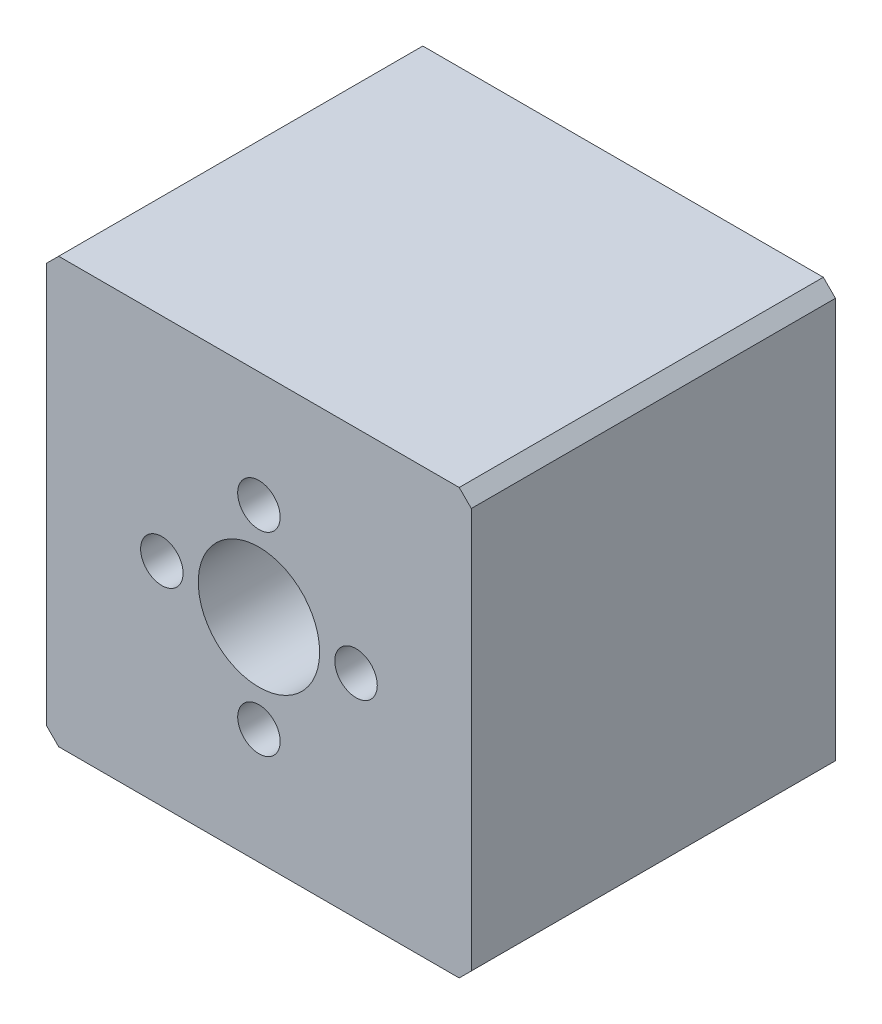
ISO-10303-21;
HEADER;
FILE_DESCRIPTION(('STEP AP214'),'2;1');
FILE_NAME('part.step','',(''),(''),'','','');
FILE_SCHEMA(('AUTOMOTIVE_DESIGN { 1 0 10303 214 1 1 1 1 }'));
ENDSEC;
DATA;
#1=APPLICATION_CONTEXT('core data for automotive mechanical design processes');
#2=APPLICATION_PROTOCOL_DEFINITION('international standard','automotive_design',2000,#1);
#3=PRODUCT_CONTEXT('',#1,'mechanical');
#4=PRODUCT('Part','Part','',(#3));
#5=PRODUCT_RELATED_PRODUCT_CATEGORY('part','',(#4));
#6=PRODUCT_DEFINITION_FORMATION('','',#4);
#7=PRODUCT_DEFINITION_CONTEXT('part definition',#1,'design');
#8=PRODUCT_DEFINITION('design','',#6,#7);
#9=PRODUCT_DEFINITION_SHAPE('','',#8);
#10=(LENGTH_UNIT() NAMED_UNIT(*) SI_UNIT(.MILLI.,.METRE.));
#11=(NAMED_UNIT(*) PLANE_ANGLE_UNIT() SI_UNIT($,.RADIAN.));
#12=(NAMED_UNIT(*) SI_UNIT($,.STERADIAN.) SOLID_ANGLE_UNIT());
#13=UNCERTAINTY_MEASURE_WITH_UNIT(LENGTH_MEASURE(1.E-05),#10,'distance_accuracy_value','');
#14=(GEOMETRIC_REPRESENTATION_CONTEXT(3) GLOBAL_UNCERTAINTY_ASSIGNED_CONTEXT((#13)) GLOBAL_UNIT_ASSIGNED_CONTEXT((#10,
#11,#12)) REPRESENTATION_CONTEXT('',''));
#15=CARTESIAN_POINT('',(0.,0.,0.));
#16=DIRECTION('',(0.,0.,1.));
#17=DIRECTION('',(1.,0.,0.));
#18=AXIS2_PLACEMENT_3D('',#15,#16,#17);
#19=CARTESIAN_POINT('',(0.,0.,15.));
#20=DIRECTION('',(0.,0.,-1.));
#21=DIRECTION('',(-1.,0.,0.));
#22=AXIS2_PLACEMENT_3D('',#19,#20,#21);
#23=PLANE('',#22);
#24=CARTESIAN_POINT('',(0.,9.50000000000001,15.));
#25=DIRECTION('',(0.,0.,1.));
#26=DIRECTION('',(1.,0.,0.));
#27=AXIS2_PLACEMENT_3D('',#24,#25,#26);
#28=CIRCLE('',#27,1.75000000000036);
#29=CARTESIAN_POINT('',(1.75000000000036,9.50000000000001,15.));
#30=VERTEX_POINT('',#29);
#31=EDGE_CURVE('E207',#30,#30,#28,.T.);
#32=ORIENTED_EDGE('',*,*,#31,.F.);
#33=EDGE_LOOP('',(#32));
#34=FACE_BOUND('',#33,.T.);
#35=CARTESIAN_POINT('',(0.,-6.50000000000001,15.));
#36=DIRECTION('',(0.,0.,1.));
#37=DIRECTION('',(1.,0.,0.));
#38=AXIS2_PLACEMENT_3D('',#35,#36,#37);
#39=CIRCLE('',#38,1.75000000000036);
#40=CARTESIAN_POINT('',(1.75000000000036,-6.50000000000001,15.));
#41=VERTEX_POINT('',#40);
#42=EDGE_CURVE('E201',#41,#41,#39,.T.);
#43=ORIENTED_EDGE('',*,*,#42,.F.);
#44=EDGE_LOOP('',(#43));
#45=FACE_BOUND('',#44,.T.);
#46=CARTESIAN_POINT('',(8.00000000000001,1.5,15.));
#47=DIRECTION('',(0.,0.,1.));
#48=DIRECTION('',(1.,0.,0.));
#49=AXIS2_PLACEMENT_3D('',#46,#47,#48);
#50=CIRCLE('',#49,1.75000000000036);
#51=CARTESIAN_POINT('',(9.75000000000037,1.5,15.));
#52=VERTEX_POINT('',#51);
#53=EDGE_CURVE('E195',#52,#52,#50,.T.);
#54=ORIENTED_EDGE('',*,*,#53,.F.);
#55=EDGE_LOOP('',(#54));
#56=FACE_BOUND('',#55,.T.);
#57=CARTESIAN_POINT('',(-8.00000000000001,1.5,15.));
#58=DIRECTION('',(0.,0.,1.));
#59=DIRECTION('',(1.,0.,0.));
#60=AXIS2_PLACEMENT_3D('',#57,#58,#59);
#61=CIRCLE('',#60,1.75000000000036);
#62=CARTESIAN_POINT('',(-6.24999999999964,1.5,15.));
#63=VERTEX_POINT('',#62);
#64=EDGE_CURVE('E188',#63,#63,#61,.T.);
#65=ORIENTED_EDGE('',*,*,#64,.F.);
#66=EDGE_LOOP('',(#65));
#67=FACE_BOUND('',#66,.T.);
#68=DIRECTION('',(0.,-1.,0.));
#69=VECTOR('',#68,1.);
#70=CARTESIAN_POINT('',(-17.5000000000001,-16.,15.));
#71=LINE('',#70,#69);
#72=CARTESIAN_POINT('',(-17.5000000000001,17.9999999999997,15.));
#73=VERTEX_POINT('',#72);
#74=CARTESIAN_POINT('',(-17.5000000000001,-15.,15.));
#75=VERTEX_POINT('',#74);
#76=EDGE_CURVE('E137',#73,#75,#71,.T.);
#77=ORIENTED_EDGE('',*,*,#76,.T.);
#78=DIRECTION('',(-0.707106781186548,0.707106781186548,0.));
#79=VECTOR('',#78,1.);
#80=CARTESIAN_POINT('',(-16.5000000000001,-16.,15.));
#81=LINE('',#80,#79);
#82=CARTESIAN_POINT('',(-16.5000000000001,-16.,15.));
#83=VERTEX_POINT('',#82);
#84=EDGE_CURVE('E152',#75,#83,#81,.F.);
#85=ORIENTED_EDGE('',*,*,#84,.T.);
#86=DIRECTION('',(1.,0.,0.));
#87=VECTOR('',#86,1.);
#88=CARTESIAN_POINT('',(17.5000000000001,-16.,15.));
#89=LINE('',#88,#87);
#90=CARTESIAN_POINT('',(16.5000000000001,-16.,15.));
#91=VERTEX_POINT('',#90);
#92=EDGE_CURVE('E119',#83,#91,#89,.T.);
#93=ORIENTED_EDGE('',*,*,#92,.T.);
#94=DIRECTION('',(-0.707106781186548,-0.707106781186548,0.));
#95=VECTOR('',#94,1.);
#96=CARTESIAN_POINT('',(17.5000000000001,-15.,15.));
#97=LINE('',#96,#95);
#98=CARTESIAN_POINT('',(17.5000000000001,-15.,15.));
#99=VERTEX_POINT('',#98);
#100=EDGE_CURVE('E150',#91,#99,#97,.F.);
#101=ORIENTED_EDGE('',*,*,#100,.T.);
#102=DIRECTION('',(0.,1.,0.));
#103=VECTOR('',#102,1.);
#104=CARTESIAN_POINT('',(17.5000000000001,18.9999999999997,15.));
#105=LINE('',#104,#103);
#106=CARTESIAN_POINT('',(17.5000000000001,17.9999999999997,15.));
#107=VERTEX_POINT('',#106);
#108=EDGE_CURVE('E172',#99,#107,#105,.T.);
#109=ORIENTED_EDGE('',*,*,#108,.T.);
#110=DIRECTION('',(0.707106781186548,-0.707106781186548,0.));
#111=VECTOR('',#110,1.);
#112=CARTESIAN_POINT('',(16.5000000000001,18.9999999999997,15.));
#113=LINE('',#112,#111);
#114=CARTESIAN_POINT('',(16.5000000000001,18.9999999999997,15.));
#115=VERTEX_POINT('',#114);
#116=EDGE_CURVE('E54',#107,#115,#113,.F.);
#117=ORIENTED_EDGE('',*,*,#116,.T.);
#118=DIRECTION('',(-1.,0.,0.));
#119=VECTOR('',#118,1.);
#120=CARTESIAN_POINT('',(-17.5000000000001,18.9999999999997,15.));
#121=LINE('',#120,#119);
#122=CARTESIAN_POINT('',(-16.5000000000001,18.9999999999997,15.));
#123=VERTEX_POINT('',#122);
#124=EDGE_CURVE('E138',#115,#123,#121,.T.);
#125=ORIENTED_EDGE('',*,*,#124,.T.);
#126=DIRECTION('',(0.707106781186548,0.707106781186548,0.));
#127=VECTOR('',#126,1.);
#128=CARTESIAN_POINT('',(-17.5000000000001,17.9999999999997,15.));
#129=LINE('',#128,#127);
#130=EDGE_CURVE('E148',#123,#73,#129,.F.);
#131=ORIENTED_EDGE('',*,*,#130,.T.);
#132=EDGE_LOOP('',(#77,#85,#93,#101,#109,#117,#125,#131));
#133=FACE_BOUND('',#132,.T.);
#134=CARTESIAN_POINT('',(0.,1.5,15.));
#135=DIRECTION('',(0.,0.,1.));
#136=DIRECTION('',(1.,0.,0.));
#137=AXIS2_PLACEMENT_3D('',#134,#135,#136);
#138=CIRCLE('',#137,4.99999999999989);
#139=CARTESIAN_POINT('',(4.99999999999989,1.5,15.));
#140=VERTEX_POINT('',#139);
#141=EDGE_CURVE('E132',#140,#140,#138,.T.);
#142=ORIENTED_EDGE('',*,*,#141,.F.);
#143=EDGE_LOOP('',(#142));
#144=FACE_BOUND('',#143,.T.);
#145=ADVANCED_FACE('F34',(#34,#45,#56,#67,#133,#144),#23,.F.);
#146=CARTESIAN_POINT('',(0.,0.,-15.));
#147=DIRECTION('',(0.,0.,-1.));
#148=DIRECTION('',(-1.,0.,0.));
#149=AXIS2_PLACEMENT_3D('',#146,#147,#148);
#150=PLANE('',#149);
#151=DIRECTION('',(1.,0.,0.));
#152=VECTOR('',#151,1.);
#153=CARTESIAN_POINT('',(17.5000000000001,-16.,-15.));
#154=LINE('',#153,#152);
#155=CARTESIAN_POINT('',(-16.5000000000001,-16.,-15.));
#156=VERTEX_POINT('',#155);
#157=CARTESIAN_POINT('',(16.5000000000001,-16.,-15.));
#158=VERTEX_POINT('',#157);
#159=EDGE_CURVE('E116',#156,#158,#154,.T.);
#160=ORIENTED_EDGE('',*,*,#159,.F.);
#161=DIRECTION('',(0.707106781186548,-0.707106781186548,0.));
#162=VECTOR('',#161,1.);
#163=CARTESIAN_POINT('',(-16.25,-16.25,-15.));
#164=LINE('',#163,#162);
#165=CARTESIAN_POINT('',(-17.5000000000001,-15.,-15.));
#166=VERTEX_POINT('',#165);
#167=EDGE_CURVE('E99',#156,#166,#164,.F.);
#168=ORIENTED_EDGE('',*,*,#167,.T.);
#169=DIRECTION('',(0.,-1.,0.));
#170=VECTOR('',#169,1.);
#171=CARTESIAN_POINT('',(-17.5000000000001,-16.,-15.));
#172=LINE('',#171,#170);
#173=CARTESIAN_POINT('',(-17.5000000000001,17.9999999999997,-15.));
#174=VERTEX_POINT('',#173);
#175=EDGE_CURVE('E127',#174,#166,#172,.T.);
#176=ORIENTED_EDGE('',*,*,#175,.F.);
#177=DIRECTION('',(-0.707106781186548,-0.707106781186548,0.));
#178=VECTOR('',#177,1.);
#179=CARTESIAN_POINT('',(-17.7499999999999,17.7499999999999,-15.));
#180=LINE('',#179,#178);
#181=CARTESIAN_POINT('',(-16.5000000000001,18.9999999999997,-15.));
#182=VERTEX_POINT('',#181);
#183=EDGE_CURVE('E141',#174,#182,#180,.F.);
#184=ORIENTED_EDGE('',*,*,#183,.T.);
#185=DIRECTION('',(-1.,0.,0.));
#186=VECTOR('',#185,1.);
#187=CARTESIAN_POINT('',(-17.5000000000001,18.9999999999997,-15.));
#188=LINE('',#187,#186);
#189=CARTESIAN_POINT('',(16.5000000000001,18.9999999999997,-15.));
#190=VERTEX_POINT('',#189);
#191=EDGE_CURVE('E130',#190,#182,#188,.T.);
#192=ORIENTED_EDGE('',*,*,#191,.F.);
#193=DIRECTION('',(-0.707106781186548,0.707106781186548,0.));
#194=VECTOR('',#193,1.);
#195=CARTESIAN_POINT('',(17.7499999999999,17.7499999999999,-15.));
#196=LINE('',#195,#194);
#197=CARTESIAN_POINT('',(17.5000000000001,17.9999999999997,-15.));
#198=VERTEX_POINT('',#197);
#199=EDGE_CURVE('E120',#190,#198,#196,.F.);
#200=ORIENTED_EDGE('',*,*,#199,.T.);
#201=DIRECTION('',(0.,1.,0.));
#202=VECTOR('',#201,1.);
#203=CARTESIAN_POINT('',(17.5000000000001,18.9999999999997,-15.));
#204=LINE('',#203,#202);
#205=CARTESIAN_POINT('',(17.5000000000001,-15.,-15.));
#206=VERTEX_POINT('',#205);
#207=EDGE_CURVE('E126',#206,#198,#204,.T.);
#208=ORIENTED_EDGE('',*,*,#207,.F.);
#209=DIRECTION('',(0.707106781186548,0.707106781186548,0.));
#210=VECTOR('',#209,1.);
#211=CARTESIAN_POINT('',(16.25,-16.25,-15.));
#212=LINE('',#211,#210);
#213=EDGE_CURVE('E110',#206,#158,#212,.F.);
#214=ORIENTED_EDGE('',*,*,#213,.T.);
#215=EDGE_LOOP('',(#160,#168,#176,#184,#192,#200,#208,#214));
#216=FACE_BOUND('',#215,.T.);
#217=CARTESIAN_POINT('',(0.,1.5,-15.));
#218=DIRECTION('',(0.,0.,1.));
#219=DIRECTION('',(1.,0.,0.));
#220=AXIS2_PLACEMENT_3D('',#217,#218,#219);
#221=CIRCLE('',#220,4.99999999999989);
#222=CARTESIAN_POINT('',(4.99999999999989,1.5,-15.));
#223=VERTEX_POINT('',#222);
#224=EDGE_CURVE('E175',#223,#223,#221,.T.);
#225=ORIENTED_EDGE('',*,*,#224,.T.);
#226=EDGE_LOOP('',(#225));
#227=FACE_BOUND('',#226,.T.);
#228=ADVANCED_FACE('F123',(#216,#227),#150,.T.);
#229=CARTESIAN_POINT('',(-17.5000000000001,-16.,15.));
#230=DIRECTION('',(1.,0.,0.));
#231=DIRECTION('',(0.,0.,-1.));
#232=AXIS2_PLACEMENT_3D('',#229,#230,#231);
#233=PLANE('',#232);
#234=ORIENTED_EDGE('',*,*,#175,.T.);
#235=DIRECTION('',(0.,0.,1.));
#236=VECTOR('',#235,1.);
#237=CARTESIAN_POINT('',(-17.5000000000001,-15.,15.));
#238=LINE('',#237,#236);
#239=EDGE_CURVE('E104',#166,#75,#238,.T.);
#240=ORIENTED_EDGE('',*,*,#239,.T.);
#241=ORIENTED_EDGE('',*,*,#76,.F.);
#242=DIRECTION('',(0.,0.,-1.));
#243=VECTOR('',#242,1.);
#244=CARTESIAN_POINT('',(-17.5000000000001,17.9999999999997,15.));
#245=LINE('',#244,#243);
#246=EDGE_CURVE('E109',#73,#174,#245,.T.);
#247=ORIENTED_EDGE('',*,*,#246,.T.);
#248=EDGE_LOOP('',(#234,#240,#241,#247));
#249=FACE_BOUND('',#248,.T.);
#250=ADVANCED_FACE('F169',(#249),#233,.F.);
#251=CARTESIAN_POINT('',(17.5000000000001,-16.,15.));
#252=DIRECTION('',(0.,1.,0.));
#253=DIRECTION('',(0.,0.,1.));
#254=AXIS2_PLACEMENT_3D('',#251,#252,#253);
#255=PLANE('',#254);
#256=CARTESIAN_POINT('',(-12.5,-16.,8.));
#257=DIRECTION('',(0.,1.,0.));
#258=DIRECTION('',(0.,0.,-1.));
#259=AXIS2_PLACEMENT_3D('',#256,#257,#258);
#260=CIRCLE('',#259,2.);
#261=CARTESIAN_POINT('',(-12.5,-16.,6.));
#262=VERTEX_POINT('',#261);
#263=EDGE_CURVE('E230',#262,#262,#260,.T.);
#264=ORIENTED_EDGE('',*,*,#263,.T.);
#265=EDGE_LOOP('',(#264));
#266=FACE_BOUND('',#265,.T.);
#267=CARTESIAN_POINT('',(-12.5,-16.,-8.));
#268=DIRECTION('',(0.,1.,0.));
#269=DIRECTION('',(0.,0.,-1.));
#270=AXIS2_PLACEMENT_3D('',#267,#268,#269);
#271=CIRCLE('',#270,2.);
#272=CARTESIAN_POINT('',(-12.5,-16.,-10.));
#273=VERTEX_POINT('',#272);
#274=EDGE_CURVE('E224',#273,#273,#271,.T.);
#275=ORIENTED_EDGE('',*,*,#274,.T.);
#276=EDGE_LOOP('',(#275));
#277=FACE_BOUND('',#276,.T.);
#278=CARTESIAN_POINT('',(12.5,-16.,8.));
#279=DIRECTION('',(0.,-1.,0.));
#280=DIRECTION('',(0.,0.,-1.));
#281=AXIS2_PLACEMENT_3D('',#278,#279,#280);
#282=CIRCLE('',#281,2.);
#283=CARTESIAN_POINT('',(12.5,-16.,6.));
#284=VERTEX_POINT('',#283);
#285=EDGE_CURVE('E219',#284,#284,#282,.T.);
#286=ORIENTED_EDGE('',*,*,#285,.F.);
#287=EDGE_LOOP('',(#286));
#288=FACE_BOUND('',#287,.T.);
#289=CARTESIAN_POINT('',(12.5,-16.,-8.));
#290=DIRECTION('',(0.,-1.,0.));
#291=DIRECTION('',(0.,0.,-1.));
#292=AXIS2_PLACEMENT_3D('',#289,#290,#291);
#293=CIRCLE('',#292,2.);
#294=CARTESIAN_POINT('',(12.5,-16.,-10.));
#295=VERTEX_POINT('',#294);
#296=EDGE_CURVE('E212',#295,#295,#293,.T.);
#297=ORIENTED_EDGE('',*,*,#296,.F.);
#298=EDGE_LOOP('',(#297));
#299=FACE_BOUND('',#298,.T.);
#300=ORIENTED_EDGE('',*,*,#92,.F.);
#301=DIRECTION('',(0.,0.,-1.));
#302=VECTOR('',#301,1.);
#303=CARTESIAN_POINT('',(-16.5000000000001,-16.,15.));
#304=LINE('',#303,#302);
#305=EDGE_CURVE('E103',#83,#156,#304,.T.);
#306=ORIENTED_EDGE('',*,*,#305,.T.);
#307=ORIENTED_EDGE('',*,*,#159,.T.);
#308=DIRECTION('',(0.,0.,1.));
#309=VECTOR('',#308,1.);
#310=CARTESIAN_POINT('',(16.5000000000001,-16.,15.));
#311=LINE('',#310,#309);
#312=EDGE_CURVE('E121',#158,#91,#311,.T.);
#313=ORIENTED_EDGE('',*,*,#312,.T.);
#314=EDGE_LOOP('',(#300,#306,#307,#313));
#315=FACE_BOUND('',#314,.T.);
#316=ADVANCED_FACE('F115',(#266,#277,#288,#299,#315),#255,.F.);
#317=CARTESIAN_POINT('',(17.5000000000001,18.9999999999997,15.));
#318=DIRECTION('',(-1.,0.,0.));
#319=DIRECTION('',(0.,0.,1.));
#320=AXIS2_PLACEMENT_3D('',#317,#318,#319);
#321=PLANE('',#320);
#322=ORIENTED_EDGE('',*,*,#108,.F.);
#323=DIRECTION('',(0.,0.,-1.));
#324=VECTOR('',#323,1.);
#325=CARTESIAN_POINT('',(17.5000000000001,-15.,15.));
#326=LINE('',#325,#324);
#327=EDGE_CURVE('E156',#99,#206,#326,.T.);
#328=ORIENTED_EDGE('',*,*,#327,.T.);
#329=ORIENTED_EDGE('',*,*,#207,.T.);
#330=DIRECTION('',(0.,0.,1.));
#331=VECTOR('',#330,1.);
#332=CARTESIAN_POINT('',(17.5000000000001,17.9999999999997,15.));
#333=LINE('',#332,#331);
#334=EDGE_CURVE('E154',#198,#107,#333,.T.);
#335=ORIENTED_EDGE('',*,*,#334,.T.);
#336=EDGE_LOOP('',(#322,#328,#329,#335));
#337=FACE_BOUND('',#336,.T.);
#338=ADVANCED_FACE('F310',(#337),#321,.F.);
#339=CARTESIAN_POINT('',(-17.5000000000001,18.9999999999997,15.));
#340=DIRECTION('',(0.,-1.,0.));
#341=DIRECTION('',(0.,0.,-1.));
#342=AXIS2_PLACEMENT_3D('',#339,#340,#341);
#343=PLANE('',#342);
#344=ORIENTED_EDGE('',*,*,#191,.T.);
#345=DIRECTION('',(0.,0.,1.));
#346=VECTOR('',#345,1.);
#347=CARTESIAN_POINT('',(-16.5000000000001,18.9999999999997,15.));
#348=LINE('',#347,#346);
#349=EDGE_CURVE('E11',#182,#123,#348,.T.);
#350=ORIENTED_EDGE('',*,*,#349,.T.);
#351=ORIENTED_EDGE('',*,*,#124,.F.);
#352=DIRECTION('',(0.,0.,-1.));
#353=VECTOR('',#352,1.);
#354=CARTESIAN_POINT('',(16.5000000000001,18.9999999999997,15.));
#355=LINE('',#354,#353);
#356=EDGE_CURVE('E42',#115,#190,#355,.T.);
#357=ORIENTED_EDGE('',*,*,#356,.T.);
#358=EDGE_LOOP('',(#344,#350,#351,#357));
#359=FACE_BOUND('',#358,.T.);
#360=ADVANCED_FACE('F161',(#359),#343,.F.);
#361=CARTESIAN_POINT('',(0.,1.5,15.));
#362=DIRECTION('',(0.,0.,-1.));
#363=DIRECTION('',(-1.,0.,0.));
#364=AXIS2_PLACEMENT_3D('',#361,#362,#363);
#365=CYLINDRICAL_SURFACE('',#364,4.99999999999989);
#366=ORIENTED_EDGE('',*,*,#141,.T.);
#367=EDGE_LOOP('',(#366));
#368=FACE_BOUND('',#367,.T.);
#369=ORIENTED_EDGE('',*,*,#224,.F.);
#370=EDGE_LOOP('',(#369));
#371=FACE_BOUND('',#370,.T.);
#372=ADVANCED_FACE('F302',(#368,#371),#365,.F.);
#373=CARTESIAN_POINT('',(-8.00000000000001,1.5,5.));
#374=DIRECTION('',(0.,0.,1.));
#375=DIRECTION('',(1.,0.,0.));
#376=AXIS2_PLACEMENT_3D('',#373,#374,#375);
#377=CYLINDRICAL_SURFACE('',#376,1.75000000000036);
#378=CARTESIAN_POINT('',(-8.00000000000001,1.5,5.));
#379=DIRECTION('',(0.,0.,1.));
#380=DIRECTION('',(1.,0.,0.));
#381=AXIS2_PLACEMENT_3D('',#378,#379,#380);
#382=CIRCLE('',#381,1.75000000000036);
#383=CARTESIAN_POINT('',(-6.24999999999964,1.5,5.));
#384=VERTEX_POINT('',#383);
#385=EDGE_CURVE('E191',#384,#384,#382,.T.);
#386=ORIENTED_EDGE('',*,*,#385,.F.);
#387=EDGE_LOOP('',(#386));
#388=FACE_BOUND('',#387,.T.);
#389=ORIENTED_EDGE('',*,*,#64,.T.);
#390=EDGE_LOOP('',(#389));
#391=FACE_BOUND('',#390,.T.);
#392=ADVANCED_FACE('F298',(#388,#391),#377,.F.);
#393=CARTESIAN_POINT('',(-8.00000000000001,1.5,5.));
#394=DIRECTION('',(0.,0.,1.));
#395=DIRECTION('',(1.,0.,0.));
#396=AXIS2_PLACEMENT_3D('',#393,#394,#395);
#397=PLANE('',#396);
#398=ORIENTED_EDGE('',*,*,#385,.T.);
#399=EDGE_LOOP('',(#398));
#400=FACE_BOUND('',#399,.T.);
#401=ADVANCED_FACE('F294',(#400),#397,.T.);
#402=CARTESIAN_POINT('',(8.00000000000001,1.5,5.));
#403=DIRECTION('',(0.,0.,1.));
#404=DIRECTION('',(1.,0.,0.));
#405=AXIS2_PLACEMENT_3D('',#402,#403,#404);
#406=CYLINDRICAL_SURFACE('',#405,1.75000000000036);
#407=CARTESIAN_POINT('',(8.00000000000001,1.5,5.));
#408=DIRECTION('',(0.,0.,1.));
#409=DIRECTION('',(1.,0.,0.));
#410=AXIS2_PLACEMENT_3D('',#407,#408,#409);
#411=CIRCLE('',#410,1.75000000000036);
#412=CARTESIAN_POINT('',(9.75000000000037,1.5,5.));
#413=VERTEX_POINT('',#412);
#414=EDGE_CURVE('E198',#413,#413,#411,.T.);
#415=ORIENTED_EDGE('',*,*,#414,.F.);
#416=EDGE_LOOP('',(#415));
#417=FACE_BOUND('',#416,.T.);
#418=ORIENTED_EDGE('',*,*,#53,.T.);
#419=EDGE_LOOP('',(#418));
#420=FACE_BOUND('',#419,.T.);
#421=ADVANCED_FACE('F290',(#417,#420),#406,.F.);
#422=CARTESIAN_POINT('',(8.00000000000001,1.5,5.));
#423=DIRECTION('',(0.,0.,1.));
#424=DIRECTION('',(1.,0.,0.));
#425=AXIS2_PLACEMENT_3D('',#422,#423,#424);
#426=PLANE('',#425);
#427=ORIENTED_EDGE('',*,*,#414,.T.);
#428=EDGE_LOOP('',(#427));
#429=FACE_BOUND('',#428,.T.);
#430=ADVANCED_FACE('F286',(#429),#426,.T.);
#431=CARTESIAN_POINT('',(0.,-6.50000000000001,5.));
#432=DIRECTION('',(0.,0.,1.));
#433=DIRECTION('',(1.,0.,0.));
#434=AXIS2_PLACEMENT_3D('',#431,#432,#433);
#435=CYLINDRICAL_SURFACE('',#434,1.75000000000036);
#436=CARTESIAN_POINT('',(0.,-6.50000000000001,5.));
#437=DIRECTION('',(0.,0.,1.));
#438=DIRECTION('',(1.,0.,0.));
#439=AXIS2_PLACEMENT_3D('',#436,#437,#438);
#440=CIRCLE('',#439,1.75000000000036);
#441=CARTESIAN_POINT('',(1.75000000000036,-6.50000000000001,5.));
#442=VERTEX_POINT('',#441);
#443=EDGE_CURVE('E204',#442,#442,#440,.T.);
#444=ORIENTED_EDGE('',*,*,#443,.F.);
#445=EDGE_LOOP('',(#444));
#446=FACE_BOUND('',#445,.T.);
#447=ORIENTED_EDGE('',*,*,#42,.T.);
#448=EDGE_LOOP('',(#447));
#449=FACE_BOUND('',#448,.T.);
#450=ADVANCED_FACE('F282',(#446,#449),#435,.F.);
#451=CARTESIAN_POINT('',(0.,-6.50000000000001,5.));
#452=DIRECTION('',(0.,0.,1.));
#453=DIRECTION('',(1.,0.,0.));
#454=AXIS2_PLACEMENT_3D('',#451,#452,#453);
#455=PLANE('',#454);
#456=ORIENTED_EDGE('',*,*,#443,.T.);
#457=EDGE_LOOP('',(#456));
#458=FACE_BOUND('',#457,.T.);
#459=ADVANCED_FACE('F278',(#458),#455,.T.);
#460=CARTESIAN_POINT('',(0.,9.50000000000001,5.));
#461=DIRECTION('',(0.,0.,1.));
#462=DIRECTION('',(1.,0.,0.));
#463=AXIS2_PLACEMENT_3D('',#460,#461,#462);
#464=CYLINDRICAL_SURFACE('',#463,1.75000000000036);
#465=CARTESIAN_POINT('',(0.,9.50000000000001,5.));
#466=DIRECTION('',(0.,0.,1.));
#467=DIRECTION('',(1.,0.,0.));
#468=AXIS2_PLACEMENT_3D('',#465,#466,#467);
#469=CIRCLE('',#468,1.75000000000036);
#470=CARTESIAN_POINT('',(1.75000000000036,9.50000000000001,5.));
#471=VERTEX_POINT('',#470);
#472=EDGE_CURVE('E186',#471,#471,#469,.T.);
#473=ORIENTED_EDGE('',*,*,#472,.F.);
#474=EDGE_LOOP('',(#473));
#475=FACE_BOUND('',#474,.T.);
#476=ORIENTED_EDGE('',*,*,#31,.T.);
#477=EDGE_LOOP('',(#476));
#478=FACE_BOUND('',#477,.T.);
#479=ADVANCED_FACE('F274',(#475,#478),#464,.F.);
#480=CARTESIAN_POINT('',(0.,9.50000000000001,5.));
#481=DIRECTION('',(0.,0.,1.));
#482=DIRECTION('',(1.,0.,0.));
#483=AXIS2_PLACEMENT_3D('',#480,#481,#482);
#484=PLANE('',#483);
#485=ORIENTED_EDGE('',*,*,#472,.T.);
#486=EDGE_LOOP('',(#485));
#487=FACE_BOUND('',#486,.T.);
#488=ADVANCED_FACE('F271',(#487),#484,.T.);
#489=CARTESIAN_POINT('',(-16.5000000000001,-16.,15.));
#490=DIRECTION('',(0.707106781186547,0.707106781186547,0.));
#491=DIRECTION('',(0.,0.,-1.));
#492=AXIS2_PLACEMENT_3D('',#489,#490,#491);
#493=PLANE('',#492);
#494=ORIENTED_EDGE('',*,*,#84,.F.);
#495=ORIENTED_EDGE('',*,*,#239,.F.);
#496=ORIENTED_EDGE('',*,*,#167,.F.);
#497=ORIENTED_EDGE('',*,*,#305,.F.);
#498=EDGE_LOOP('',(#494,#495,#496,#497));
#499=FACE_BOUND('',#498,.T.);
#500=ADVANCED_FACE('F102',(#499),#493,.F.);
#501=CARTESIAN_POINT('',(17.5000000000001,-15.,15.));
#502=DIRECTION('',(-0.707106781186547,0.707106781186547,0.));
#503=DIRECTION('',(0.,0.,-1.));
#504=AXIS2_PLACEMENT_3D('',#501,#502,#503);
#505=PLANE('',#504);
#506=ORIENTED_EDGE('',*,*,#100,.F.);
#507=ORIENTED_EDGE('',*,*,#312,.F.);
#508=ORIENTED_EDGE('',*,*,#213,.F.);
#509=ORIENTED_EDGE('',*,*,#327,.F.);
#510=EDGE_LOOP('',(#506,#507,#508,#509));
#511=FACE_BOUND('',#510,.T.);
#512=ADVANCED_FACE('F321',(#511),#505,.F.);
#513=CARTESIAN_POINT('',(-17.5000000000001,17.9999999999997,15.));
#514=DIRECTION('',(0.707106781186547,-0.707106781186547,0.));
#515=DIRECTION('',(0.,0.,-1.));
#516=AXIS2_PLACEMENT_3D('',#513,#514,#515);
#517=PLANE('',#516);
#518=ORIENTED_EDGE('',*,*,#130,.F.);
#519=ORIENTED_EDGE('',*,*,#349,.F.);
#520=ORIENTED_EDGE('',*,*,#183,.F.);
#521=ORIENTED_EDGE('',*,*,#246,.F.);
#522=EDGE_LOOP('',(#518,#519,#520,#521));
#523=FACE_BOUND('',#522,.T.);
#524=ADVANCED_FACE('F166',(#523),#517,.F.);
#525=CARTESIAN_POINT('',(16.5000000000001,18.9999999999997,15.));
#526=DIRECTION('',(-0.707106781186547,-0.707106781186547,0.));
#527=DIRECTION('',(0.,0.,-1.));
#528=AXIS2_PLACEMENT_3D('',#525,#526,#527);
#529=PLANE('',#528);
#530=ORIENTED_EDGE('',*,*,#116,.F.);
#531=ORIENTED_EDGE('',*,*,#334,.F.);
#532=ORIENTED_EDGE('',*,*,#199,.F.);
#533=ORIENTED_EDGE('',*,*,#356,.F.);
#534=EDGE_LOOP('',(#530,#531,#532,#533));
#535=FACE_BOUND('',#534,.T.);
#536=ADVANCED_FACE('F36',(#535),#529,.F.);
#537=CARTESIAN_POINT('',(12.5,-6.00000000000001,-8.));
#538=DIRECTION('',(0.,-1.,0.));
#539=DIRECTION('',(0.,0.,-1.));
#540=AXIS2_PLACEMENT_3D('',#537,#538,#539);
#541=CYLINDRICAL_SURFACE('',#540,2.);
#542=CARTESIAN_POINT('',(12.5,-6.00000000000001,-8.));
#543=DIRECTION('',(0.,-1.,0.));
#544=DIRECTION('',(0.,0.,-1.));
#545=AXIS2_PLACEMENT_3D('',#542,#543,#544);
#546=CIRCLE('',#545,2.);
#547=CARTESIAN_POINT('',(12.5,-6.00000000000001,-10.));
#548=VERTEX_POINT('',#547);
#549=EDGE_CURVE('E215',#548,#548,#546,.T.);
#550=ORIENTED_EDGE('',*,*,#549,.F.);
#551=EDGE_LOOP('',(#550));
#552=FACE_BOUND('',#551,.T.);
#553=ORIENTED_EDGE('',*,*,#296,.T.);
#554=EDGE_LOOP('',(#553));
#555=FACE_BOUND('',#554,.T.);
#556=ADVANCED_FACE('F266',(#552,#555),#541,.F.);
#557=CARTESIAN_POINT('',(12.5,-6.00000000000001,-8.));
#558=DIRECTION('',(0.,-1.,0.));
#559=DIRECTION('',(0.,0.,-1.));
#560=AXIS2_PLACEMENT_3D('',#557,#558,#559);
#561=PLANE('',#560);
#562=ORIENTED_EDGE('',*,*,#549,.T.);
#563=EDGE_LOOP('',(#562));
#564=FACE_BOUND('',#563,.T.);
#565=ADVANCED_FACE('F262',(#564),#561,.T.);
#566=CARTESIAN_POINT('',(12.5,-6.00000000000001,8.));
#567=DIRECTION('',(0.,-1.,0.));
#568=DIRECTION('',(0.,0.,-1.));
#569=AXIS2_PLACEMENT_3D('',#566,#567,#568);
#570=CYLINDRICAL_SURFACE('',#569,2.);
#571=CARTESIAN_POINT('',(12.5,-6.00000000000001,8.));
#572=DIRECTION('',(0.,-1.,0.));
#573=DIRECTION('',(0.,0.,-1.));
#574=AXIS2_PLACEMENT_3D('',#571,#572,#573);
#575=CIRCLE('',#574,2.);
#576=CARTESIAN_POINT('',(12.5,-6.00000000000001,6.));
#577=VERTEX_POINT('',#576);
#578=EDGE_CURVE('E192',#577,#577,#575,.T.);
#579=ORIENTED_EDGE('',*,*,#578,.F.);
#580=EDGE_LOOP('',(#579));
#581=FACE_BOUND('',#580,.T.);
#582=ORIENTED_EDGE('',*,*,#285,.T.);
#583=EDGE_LOOP('',(#582));
#584=FACE_BOUND('',#583,.T.);
#585=ADVANCED_FACE('F258',(#581,#584),#570,.F.);
#586=CARTESIAN_POINT('',(12.5,-6.00000000000001,8.));
#587=DIRECTION('',(0.,-1.,0.));
#588=DIRECTION('',(0.,0.,-1.));
#589=AXIS2_PLACEMENT_3D('',#586,#587,#588);
#590=PLANE('',#589);
#591=ORIENTED_EDGE('',*,*,#578,.T.);
#592=EDGE_LOOP('',(#591));
#593=FACE_BOUND('',#592,.T.);
#594=ADVANCED_FACE('F254',(#593),#590,.T.);
#595=CARTESIAN_POINT('',(-12.5,-6.00000000000001,-8.));
#596=DIRECTION('',(0.,-1.,0.));
#597=DIRECTION('',(0.,0.,-1.));
#598=AXIS2_PLACEMENT_3D('',#595,#596,#597);
#599=CYLINDRICAL_SURFACE('',#598,2.);
#600=CARTESIAN_POINT('',(-12.5,-6.00000000000001,-8.));
#601=DIRECTION('',(0.,1.,0.));
#602=DIRECTION('',(0.,0.,-1.));
#603=AXIS2_PLACEMENT_3D('',#600,#601,#602);
#604=CIRCLE('',#603,2.);
#605=CARTESIAN_POINT('',(-12.5,-6.00000000000001,-10.));
#606=VERTEX_POINT('',#605);
#607=EDGE_CURVE('E227',#606,#606,#604,.T.);
#608=ORIENTED_EDGE('',*,*,#607,.T.);
#609=EDGE_LOOP('',(#608));
#610=FACE_BOUND('',#609,.T.);
#611=ORIENTED_EDGE('',*,*,#274,.F.);
#612=EDGE_LOOP('',(#611));
#613=FACE_BOUND('',#612,.T.);
#614=ADVANCED_FACE('F250',(#610,#613),#599,.F.);
#615=CARTESIAN_POINT('',(-12.5,-6.00000000000001,-8.));
#616=DIRECTION('',(0.,-1.,0.));
#617=DIRECTION('',(0.,0.,-1.));
#618=AXIS2_PLACEMENT_3D('',#615,#616,#617);
#619=PLANE('',#618);
#620=ORIENTED_EDGE('',*,*,#607,.F.);
#621=EDGE_LOOP('',(#620));
#622=FACE_BOUND('',#621,.T.);
#623=ADVANCED_FACE('F245',(#622),#619,.T.);
#624=CARTESIAN_POINT('',(-12.5,-6.00000000000001,8.));
#625=DIRECTION('',(0.,-1.,0.));
#626=DIRECTION('',(0.,0.,-1.));
#627=AXIS2_PLACEMENT_3D('',#624,#625,#626);
#628=CYLINDRICAL_SURFACE('',#627,2.);
#629=CARTESIAN_POINT('',(-12.5,-6.00000000000001,8.));
#630=DIRECTION('',(0.,1.,0.));
#631=DIRECTION('',(0.,0.,-1.));
#632=AXIS2_PLACEMENT_3D('',#629,#630,#631);
#633=CIRCLE('',#632,2.);
#634=CARTESIAN_POINT('',(-12.5,-6.00000000000001,6.));
#635=VERTEX_POINT('',#634);
#636=EDGE_CURVE('E216',#635,#635,#633,.T.);
#637=ORIENTED_EDGE('',*,*,#636,.T.);
#638=EDGE_LOOP('',(#637));
#639=FACE_BOUND('',#638,.T.);
#640=ORIENTED_EDGE('',*,*,#263,.F.);
#641=EDGE_LOOP('',(#640));
#642=FACE_BOUND('',#641,.T.);
#643=ADVANCED_FACE('F236',(#639,#642),#628,.F.);
#644=CARTESIAN_POINT('',(-12.5,-6.00000000000001,8.));
#645=DIRECTION('',(0.,-1.,0.));
#646=DIRECTION('',(0.,0.,-1.));
#647=AXIS2_PLACEMENT_3D('',#644,#645,#646);
#648=PLANE('',#647);
#649=ORIENTED_EDGE('',*,*,#636,.F.);
#650=EDGE_LOOP('',(#649));
#651=FACE_BOUND('',#650,.T.);
#652=ADVANCED_FACE('F239',(#651),#648,.T.);
#653=CLOSED_SHELL('',(#145,#228,#250,#316,#338,#360,#372,#392,#401,#421,#430,#450,#459,#479,
#488,#500,#512,#524,#536,#556,#565,#585,#594,#614,#623,#643,#652));
#654=MANIFOLD_SOLID_BREP('B2',#653);
#655=ADVANCED_BREP_SHAPE_REPRESENTATION('',(#18,#654),#14);
#656=SHAPE_DEFINITION_REPRESENTATION(#9,#655);
ENDSEC;
END-ISO-10303-21;
